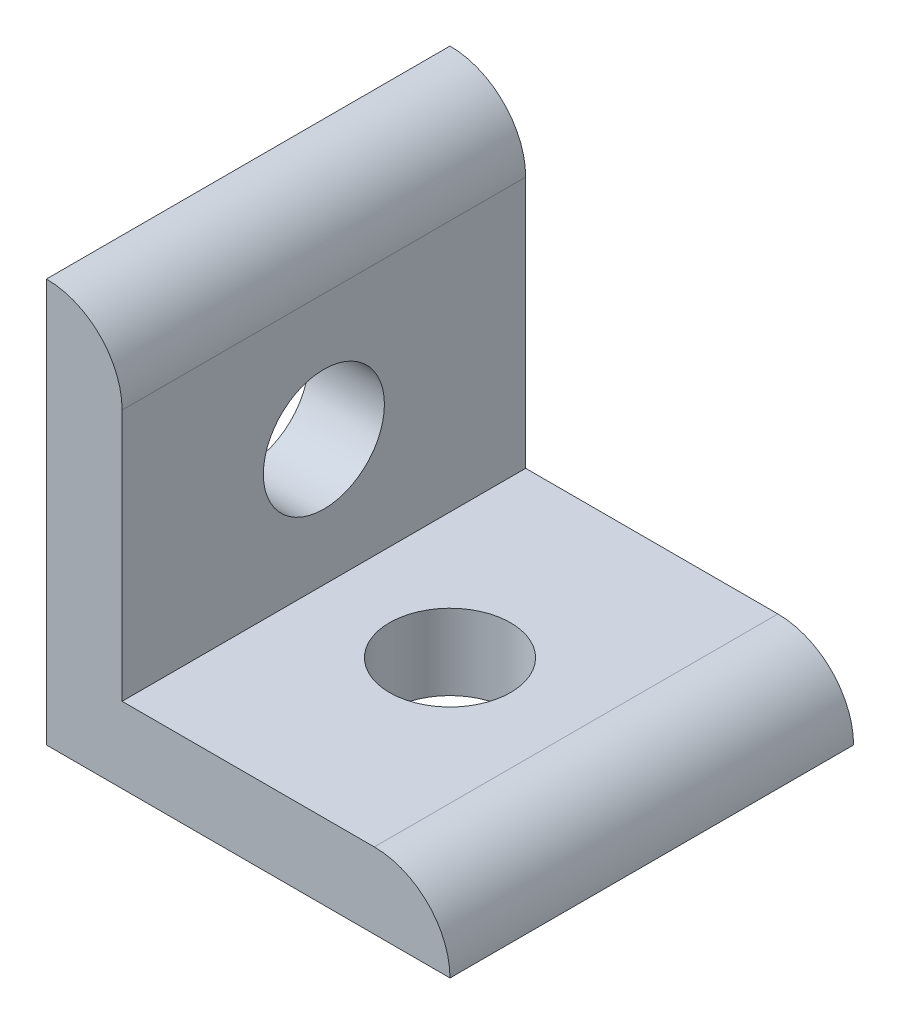
ISO-10303-21;
HEADER;
FILE_DESCRIPTION(('STEP AP214'),'2;1');
FILE_NAME('part.step','',(''),(''),'','','');
FILE_SCHEMA(('AUTOMOTIVE_DESIGN { 1 0 10303 214 1 1 1 1 }'));
ENDSEC;
DATA;
#1=APPLICATION_CONTEXT('core data for automotive mechanical design processes');
#2=APPLICATION_PROTOCOL_DEFINITION('international standard','automotive_design',2000,#1);
#3=PRODUCT_CONTEXT('',#1,'mechanical');
#4=PRODUCT('Part','Part','',(#3));
#5=PRODUCT_RELATED_PRODUCT_CATEGORY('part','',(#4));
#6=PRODUCT_DEFINITION_FORMATION('','',#4);
#7=PRODUCT_DEFINITION_CONTEXT('part definition',#1,'design');
#8=PRODUCT_DEFINITION('design','',#6,#7);
#9=PRODUCT_DEFINITION_SHAPE('','',#8);
#10=(LENGTH_UNIT() NAMED_UNIT(*) SI_UNIT(.MILLI.,.METRE.));
#11=(NAMED_UNIT(*) PLANE_ANGLE_UNIT() SI_UNIT($,.RADIAN.));
#12=(NAMED_UNIT(*) SI_UNIT($,.STERADIAN.) SOLID_ANGLE_UNIT());
#13=UNCERTAINTY_MEASURE_WITH_UNIT(LENGTH_MEASURE(1.E-05),#10,'distance_accuracy_value','');
#14=(GEOMETRIC_REPRESENTATION_CONTEXT(3) GLOBAL_UNCERTAINTY_ASSIGNED_CONTEXT((#13)) GLOBAL_UNIT_ASSIGNED_CONTEXT((#10,
#11,#12)) REPRESENTATION_CONTEXT('',''));
#15=CARTESIAN_POINT('',(0.,0.,0.));
#16=DIRECTION('',(0.,0.,1.));
#17=DIRECTION('',(1.,0.,0.));
#18=AXIS2_PLACEMENT_3D('',#15,#16,#17);
#19=CARTESIAN_POINT('',(0.,0.,25.4));
#20=DIRECTION('',(0.,0.,-1.));
#21=DIRECTION('',(-1.,0.,0.));
#22=AXIS2_PLACEMENT_3D('',#19,#20,#21);
#23=PLANE('',#22);
#24=DIRECTION('',(1.,0.,0.));
#25=VECTOR('',#24,1.);
#26=CARTESIAN_POINT('',(0.,0.,25.4));
#27=LINE('',#26,#25);
#28=CARTESIAN_POINT('',(0.,0.,25.4));
#29=VERTEX_POINT('',#28);
#30=CARTESIAN_POINT('',(25.4,0.,25.4));
#31=VERTEX_POINT('',#30);
#32=EDGE_CURVE('E124',#29,#31,#27,.T.);
#33=ORIENTED_EDGE('',*,*,#32,.T.);
#34=CARTESIAN_POINT('',(20.6375,0.,25.4));
#35=DIRECTION('',(0.,0.,-1.));
#36=DIRECTION('',(-1.,0.,0.));
#37=AXIS2_PLACEMENT_3D('',#34,#35,#36);
#38=CIRCLE('',#37,4.7625);
#39=CARTESIAN_POINT('',(20.6375,4.7625,25.4));
#40=VERTEX_POINT('',#39);
#41=EDGE_CURVE('E49',#31,#40,#38,.F.);
#42=ORIENTED_EDGE('',*,*,#41,.T.);
#43=DIRECTION('',(1.,0.,0.));
#44=VECTOR('',#43,1.);
#45=CARTESIAN_POINT('',(0.,4.7625,25.4));
#46=LINE('',#45,#44);
#47=CARTESIAN_POINT('',(4.7625,4.7625,25.4));
#48=VERTEX_POINT('',#47);
#49=EDGE_CURVE('E99',#48,#40,#46,.T.);
#50=ORIENTED_EDGE('',*,*,#49,.F.);
#51=DIRECTION('',(0.,-1.,0.));
#52=VECTOR('',#51,1.);
#53=CARTESIAN_POINT('',(4.7625,0.,25.4));
#54=LINE('',#53,#52);
#55=CARTESIAN_POINT('',(4.7625,20.6375,25.4));
#56=VERTEX_POINT('',#55);
#57=EDGE_CURVE('E91',#56,#48,#54,.T.);
#58=ORIENTED_EDGE('',*,*,#57,.F.);
#59=CARTESIAN_POINT('',(0.,20.6375,25.4));
#60=DIRECTION('',(0.,0.,-1.));
#61=DIRECTION('',(-1.,0.,0.));
#62=AXIS2_PLACEMENT_3D('',#59,#60,#61);
#63=CIRCLE('',#62,4.7625);
#64=CARTESIAN_POINT('',(0.,25.4,25.4));
#65=VERTEX_POINT('',#64);
#66=EDGE_CURVE('E154',#56,#65,#63,.F.);
#67=ORIENTED_EDGE('',*,*,#66,.T.);
#68=DIRECTION('',(0.,-1.,0.));
#69=VECTOR('',#68,1.);
#70=CARTESIAN_POINT('',(0.,0.,25.4));
#71=LINE('',#70,#69);
#72=EDGE_CURVE('E120',#65,#29,#71,.T.);
#73=ORIENTED_EDGE('',*,*,#72,.T.);
#74=EDGE_LOOP('',(#33,#42,#50,#58,#67,#73));
#75=FACE_BOUND('',#74,.T.);
#76=ADVANCED_FACE('F39',(#75),#23,.F.);
#77=CARTESIAN_POINT('',(0.,0.,0.));
#78=DIRECTION('',(0.,0.,-1.));
#79=DIRECTION('',(-1.,0.,0.));
#80=AXIS2_PLACEMENT_3D('',#77,#78,#79);
#81=PLANE('',#80);
#82=DIRECTION('',(1.,0.,0.));
#83=VECTOR('',#82,1.);
#84=CARTESIAN_POINT('',(0.,4.7625,0.));
#85=LINE('',#84,#83);
#86=CARTESIAN_POINT('',(4.7625,4.7625,0.));
#87=VERTEX_POINT('',#86);
#88=CARTESIAN_POINT('',(20.6375,4.7625,0.));
#89=VERTEX_POINT('',#88);
#90=EDGE_CURVE('E100',#87,#89,#85,.T.);
#91=ORIENTED_EDGE('',*,*,#90,.T.);
#92=CARTESIAN_POINT('',(20.6375,0.,0.));
#93=DIRECTION('',(0.,0.,-1.));
#94=DIRECTION('',(-1.,0.,0.));
#95=AXIS2_PLACEMENT_3D('',#92,#93,#94);
#96=CIRCLE('',#95,4.7625);
#97=CARTESIAN_POINT('',(25.4,0.,0.));
#98=VERTEX_POINT('',#97);
#99=EDGE_CURVE('E151',#89,#98,#96,.T.);
#100=ORIENTED_EDGE('',*,*,#99,.T.);
#101=DIRECTION('',(1.,0.,0.));
#102=VECTOR('',#101,1.);
#103=CARTESIAN_POINT('',(0.,0.,0.));
#104=LINE('',#103,#102);
#105=CARTESIAN_POINT('',(0.,0.,0.));
#106=VERTEX_POINT('',#105);
#107=EDGE_CURVE('E125',#106,#98,#104,.T.);
#108=ORIENTED_EDGE('',*,*,#107,.F.);
#109=DIRECTION('',(0.,-1.,0.));
#110=VECTOR('',#109,1.);
#111=CARTESIAN_POINT('',(0.,0.,0.));
#112=LINE('',#111,#110);
#113=CARTESIAN_POINT('',(0.,25.4,0.));
#114=VERTEX_POINT('',#113);
#115=EDGE_CURVE('E110',#114,#106,#112,.T.);
#116=ORIENTED_EDGE('',*,*,#115,.F.);
#117=CARTESIAN_POINT('',(0.,20.6375,0.));
#118=DIRECTION('',(0.,0.,-1.));
#119=DIRECTION('',(-1.,0.,0.));
#120=AXIS2_PLACEMENT_3D('',#117,#118,#119);
#121=CIRCLE('',#120,4.7625);
#122=CARTESIAN_POINT('',(4.7625,20.6375,0.));
#123=VERTEX_POINT('',#122);
#124=EDGE_CURVE('E63',#114,#123,#121,.T.);
#125=ORIENTED_EDGE('',*,*,#124,.T.);
#126=DIRECTION('',(0.,-1.,0.));
#127=VECTOR('',#126,1.);
#128=CARTESIAN_POINT('',(4.7625,0.,0.));
#129=LINE('',#128,#127);
#130=EDGE_CURVE('E119',#123,#87,#129,.T.);
#131=ORIENTED_EDGE('',*,*,#130,.T.);
#132=EDGE_LOOP('',(#91,#100,#108,#116,#125,#131));
#133=FACE_BOUND('',#132,.T.);
#134=ADVANCED_FACE('F192',(#133),#81,.T.);
#135=CARTESIAN_POINT('',(0.,0.,25.4));
#136=DIRECTION('',(1.,0.,0.));
#137=DIRECTION('',(0.,0.,-1.));
#138=AXIS2_PLACEMENT_3D('',#135,#136,#137);
#139=PLANE('',#138);
#140=CARTESIAN_POINT('',(0.,12.7,12.7));
#141=DIRECTION('',(-1.,0.,0.));
#142=DIRECTION('',(0.,0.,1.));
#143=AXIS2_PLACEMENT_3D('',#140,#141,#142);
#144=CIRCLE('',#143,3.81);
#145=CARTESIAN_POINT('',(0.,12.7,16.51));
#146=VERTEX_POINT('',#145);
#147=EDGE_CURVE('E161',#146,#146,#144,.T.);
#148=ORIENTED_EDGE('',*,*,#147,.F.);
#149=EDGE_LOOP('',(#148));
#150=FACE_BOUND('',#149,.T.);
#151=ORIENTED_EDGE('',*,*,#115,.T.);
#152=DIRECTION('',(0.,0.,-1.));
#153=VECTOR('',#152,1.);
#154=CARTESIAN_POINT('',(0.,0.,25.4));
#155=LINE('',#154,#153);
#156=EDGE_CURVE('E142',#29,#106,#155,.T.);
#157=ORIENTED_EDGE('',*,*,#156,.F.);
#158=ORIENTED_EDGE('',*,*,#72,.F.);
#159=DIRECTION('',(0.,0.,-1.));
#160=VECTOR('',#159,1.);
#161=CARTESIAN_POINT('',(0.,25.4,25.4));
#162=LINE('',#161,#160);
#163=EDGE_CURVE('E128',#65,#114,#162,.T.);
#164=ORIENTED_EDGE('',*,*,#163,.T.);
#165=EDGE_LOOP('',(#151,#157,#158,#164));
#166=FACE_BOUND('',#165,.T.);
#167=ADVANCED_FACE('F197',(#150,#166),#139,.F.);
#168=CARTESIAN_POINT('',(0.,0.,25.4));
#169=DIRECTION('',(0.,1.,0.));
#170=DIRECTION('',(0.,0.,1.));
#171=AXIS2_PLACEMENT_3D('',#168,#169,#170);
#172=PLANE('',#171);
#173=CARTESIAN_POINT('',(12.7,0.,12.7));
#174=DIRECTION('',(0.,1.,0.));
#175=DIRECTION('',(0.,0.,1.));
#176=AXIS2_PLACEMENT_3D('',#173,#174,#175);
#177=CIRCLE('',#176,3.81);
#178=CARTESIAN_POINT('',(12.7,0.,16.51));
#179=VERTEX_POINT('',#178);
#180=EDGE_CURVE('E172',#179,#179,#177,.T.);
#181=ORIENTED_EDGE('',*,*,#180,.T.);
#182=EDGE_LOOP('',(#181));
#183=FACE_BOUND('',#182,.T.);
#184=ORIENTED_EDGE('',*,*,#107,.T.);
#185=DIRECTION('',(0.,0.,-1.));
#186=VECTOR('',#185,1.);
#187=CARTESIAN_POINT('',(25.4,0.,25.4));
#188=LINE('',#187,#186);
#189=EDGE_CURVE('E138',#31,#98,#188,.T.);
#190=ORIENTED_EDGE('',*,*,#189,.F.);
#191=ORIENTED_EDGE('',*,*,#32,.F.);
#192=ORIENTED_EDGE('',*,*,#156,.T.);
#193=EDGE_LOOP('',(#184,#190,#191,#192));
#194=FACE_BOUND('',#193,.T.);
#195=ADVANCED_FACE('F178',(#183,#194),#172,.F.);
#196=CARTESIAN_POINT('',(4.7625,0.,25.4));
#197=DIRECTION('',(1.,0.,0.));
#198=DIRECTION('',(0.,0.,-1.));
#199=AXIS2_PLACEMENT_3D('',#196,#197,#198);
#200=PLANE('',#199);
#201=CARTESIAN_POINT('',(4.7625,12.7,12.7));
#202=DIRECTION('',(1.,0.,0.));
#203=DIRECTION('',(0.,0.,-1.));
#204=AXIS2_PLACEMENT_3D('',#201,#202,#203);
#205=CIRCLE('',#204,3.81);
#206=CARTESIAN_POINT('',(4.7625,12.7,8.89));
#207=VERTEX_POINT('',#206);
#208=EDGE_CURVE('E158',#207,#207,#205,.T.);
#209=ORIENTED_EDGE('',*,*,#208,.F.);
#210=EDGE_LOOP('',(#209));
#211=FACE_BOUND('',#210,.T.);
#212=ORIENTED_EDGE('',*,*,#130,.F.);
#213=DIRECTION('',(0.,0.,-1.));
#214=VECTOR('',#213,1.);
#215=CARTESIAN_POINT('',(4.7625,20.6375,25.4));
#216=LINE('',#215,#214);
#217=EDGE_CURVE('E11',#123,#56,#216,.F.);
#218=ORIENTED_EDGE('',*,*,#217,.T.);
#219=ORIENTED_EDGE('',*,*,#57,.T.);
#220=DIRECTION('',(0.,0.,-1.));
#221=VECTOR('',#220,1.);
#222=CARTESIAN_POINT('',(4.7625,4.7625,25.4));
#223=LINE('',#222,#221);
#224=EDGE_CURVE('E94',#48,#87,#223,.T.);
#225=ORIENTED_EDGE('',*,*,#224,.T.);
#226=EDGE_LOOP('',(#212,#218,#219,#225));
#227=FACE_BOUND('',#226,.T.);
#228=ADVANCED_FACE('F93',(#211,#227),#200,.T.);
#229=CARTESIAN_POINT('',(0.,4.7625,25.4));
#230=DIRECTION('',(0.,1.,0.));
#231=DIRECTION('',(0.,0.,1.));
#232=AXIS2_PLACEMENT_3D('',#229,#230,#231);
#233=PLANE('',#232);
#234=CARTESIAN_POINT('',(12.7,4.7625,12.7));
#235=DIRECTION('',(0.,1.,0.));
#236=DIRECTION('',(0.,0.,1.));
#237=AXIS2_PLACEMENT_3D('',#234,#235,#236);
#238=CIRCLE('',#237,3.81);
#239=CARTESIAN_POINT('',(12.7,4.7625,16.51));
#240=VERTEX_POINT('',#239);
#241=EDGE_CURVE('E43',#240,#240,#238,.F.);
#242=ORIENTED_EDGE('',*,*,#241,.T.);
#243=EDGE_LOOP('',(#242));
#244=FACE_BOUND('',#243,.T.);
#245=ORIENTED_EDGE('',*,*,#49,.T.);
#246=DIRECTION('',(0.,0.,-1.));
#247=VECTOR('',#246,1.);
#248=CARTESIAN_POINT('',(20.6375,4.7625,0.));
#249=LINE('',#248,#247);
#250=EDGE_CURVE('E146',#40,#89,#249,.T.);
#251=ORIENTED_EDGE('',*,*,#250,.T.);
#252=ORIENTED_EDGE('',*,*,#90,.F.);
#253=ORIENTED_EDGE('',*,*,#224,.F.);
#254=EDGE_LOOP('',(#245,#251,#252,#253));
#255=FACE_BOUND('',#254,.T.);
#256=ADVANCED_FACE('F105',(#244,#255),#233,.T.);
#257=CARTESIAN_POINT('',(20.6375,0.,25.4));
#258=DIRECTION('',(0.,0.,1.));
#259=DIRECTION('',(1.,0.,0.));
#260=AXIS2_PLACEMENT_3D('',#257,#258,#259);
#261=CYLINDRICAL_SURFACE('',#260,4.7625);
#262=ORIENTED_EDGE('',*,*,#41,.F.);
#263=ORIENTED_EDGE('',*,*,#189,.T.);
#264=ORIENTED_EDGE('',*,*,#99,.F.);
#265=ORIENTED_EDGE('',*,*,#250,.F.);
#266=EDGE_LOOP('',(#262,#263,#264,#265));
#267=FACE_BOUND('',#266,.T.);
#268=ADVANCED_FACE('F206',(#267),#261,.T.);
#269=CARTESIAN_POINT('',(0.,20.6375,25.4));
#270=DIRECTION('',(0.,0.,1.));
#271=DIRECTION('',(1.,0.,0.));
#272=AXIS2_PLACEMENT_3D('',#269,#270,#271);
#273=CYLINDRICAL_SURFACE('',#272,4.7625);
#274=ORIENTED_EDGE('',*,*,#66,.F.);
#275=ORIENTED_EDGE('',*,*,#217,.F.);
#276=ORIENTED_EDGE('',*,*,#124,.F.);
#277=ORIENTED_EDGE('',*,*,#163,.F.);
#278=EDGE_LOOP('',(#274,#275,#276,#277));
#279=FACE_BOUND('',#278,.T.);
#280=ADVANCED_FACE('F41',(#279),#273,.T.);
#281=CARTESIAN_POINT('',(25.4,12.7,12.7));
#282=DIRECTION('',(-1.,0.,0.));
#283=DIRECTION('',(0.,0.,1.));
#284=AXIS2_PLACEMENT_3D('',#281,#282,#283);
#285=CYLINDRICAL_SURFACE('',#284,3.81);
#286=ORIENTED_EDGE('',*,*,#208,.T.);
#287=EDGE_LOOP('',(#286));
#288=FACE_BOUND('',#287,.T.);
#289=ORIENTED_EDGE('',*,*,#147,.T.);
#290=EDGE_LOOP('',(#289));
#291=FACE_BOUND('',#290,.T.);
#292=ADVANCED_FACE('F183',(#288,#291),#285,.F.);
#293=CARTESIAN_POINT('',(12.7,25.4,12.7));
#294=DIRECTION('',(0.,-1.,0.));
#295=DIRECTION('',(1.,0.,0.));
#296=AXIS2_PLACEMENT_3D('',#293,#294,#295);
#297=CYLINDRICAL_SURFACE('',#296,3.81);
#298=ORIENTED_EDGE('',*,*,#241,.F.);
#299=EDGE_LOOP('',(#298));
#300=FACE_BOUND('',#299,.T.);
#301=ORIENTED_EDGE('',*,*,#180,.F.);
#302=EDGE_LOOP('',(#301));
#303=FACE_BOUND('',#302,.T.);
#304=ADVANCED_FACE('F181',(#300,#303),#297,.F.);
#305=CLOSED_SHELL('',(#76,#134,#167,#195,#228,#256,#268,#280,#292,#304));
#306=MANIFOLD_SOLID_BREP('B2',#305);
#307=ADVANCED_BREP_SHAPE_REPRESENTATION('',(#18,#306),#14);
#308=SHAPE_DEFINITION_REPRESENTATION(#9,#307);
ENDSEC;
END-ISO-10303-21;
